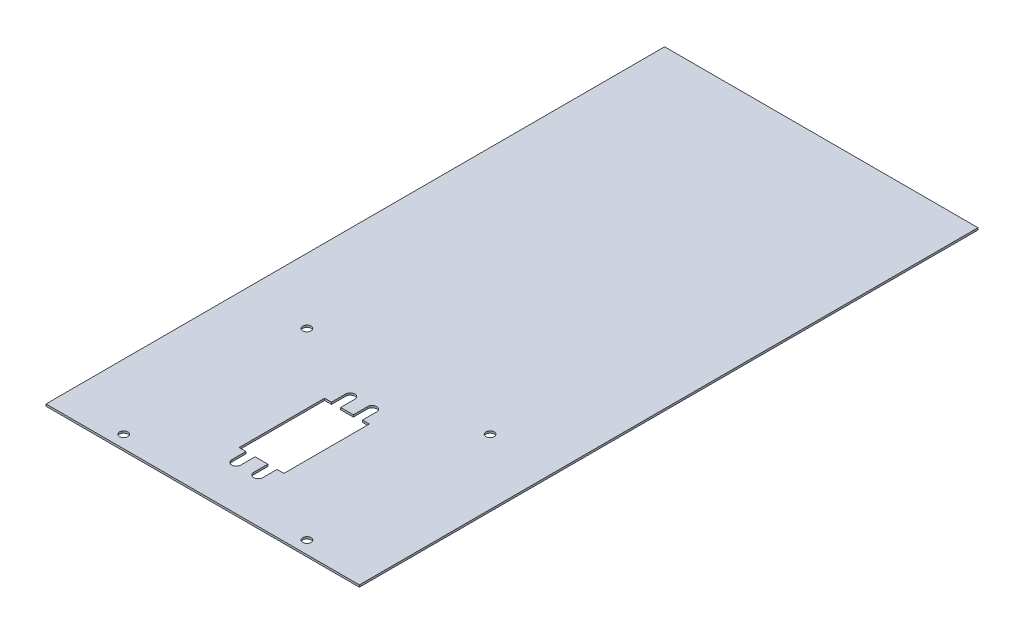
ISO-10303-21;
HEADER;
FILE_DESCRIPTION(('STEP AP214'),'2;1');
FILE_NAME('part.step','',(''),(''),'','','');
FILE_SCHEMA(('AUTOMOTIVE_DESIGN { 1 0 10303 214 1 1 1 1 }'));
ENDSEC;
DATA;
#1=APPLICATION_CONTEXT('core data for automotive mechanical design processes');
#2=APPLICATION_PROTOCOL_DEFINITION('international standard','automotive_design',2000,#1);
#3=PRODUCT_CONTEXT('',#1,'mechanical');
#4=PRODUCT('Part','Part','',(#3));
#5=PRODUCT_RELATED_PRODUCT_CATEGORY('part','',(#4));
#6=PRODUCT_DEFINITION_FORMATION('','',#4);
#7=PRODUCT_DEFINITION_CONTEXT('part definition',#1,'design');
#8=PRODUCT_DEFINITION('design','',#6,#7);
#9=PRODUCT_DEFINITION_SHAPE('','',#8);
#10=(LENGTH_UNIT() NAMED_UNIT(*) SI_UNIT(.MILLI.,.METRE.));
#11=(NAMED_UNIT(*) PLANE_ANGLE_UNIT() SI_UNIT($,.RADIAN.));
#12=(NAMED_UNIT(*) SI_UNIT($,.STERADIAN.) SOLID_ANGLE_UNIT());
#13=UNCERTAINTY_MEASURE_WITH_UNIT(LENGTH_MEASURE(1.E-05),#10,'distance_accuracy_value','');
#14=(GEOMETRIC_REPRESENTATION_CONTEXT(3) GLOBAL_UNCERTAINTY_ASSIGNED_CONTEXT((#13)) GLOBAL_UNIT_ASSIGNED_CONTEXT((#10,
#11,#12)) REPRESENTATION_CONTEXT('',''));
#15=CARTESIAN_POINT('',(0.,0.,0.));
#16=DIRECTION('',(0.,0.,1.));
#17=DIRECTION('',(1.,0.,0.));
#18=AXIS2_PLACEMENT_3D('',#15,#16,#17);
#19=CARTESIAN_POINT('',(0.,-1.,0.));
#20=DIRECTION('',(0.,1.,0.));
#21=DIRECTION('',(0.,0.,1.));
#22=AXIS2_PLACEMENT_3D('',#19,#20,#21);
#23=PLANE('',#22);
#24=CARTESIAN_POINT('',(-45.02,-0.999999999999999,263.475376963156));
#25=DIRECTION('',(0.,1.,0.));
#26=DIRECTION('',(0.,0.,1.));
#27=AXIS2_PLACEMENT_3D('',#24,#25,#26);
#28=CIRCLE('',#27,2.05000000000001);
#29=CARTESIAN_POINT('',(-45.02,-0.999999999999999,265.525376963156));
#30=VERTEX_POINT('',#29);
#31=EDGE_CURVE('E643',#30,#30,#28,.T.);
#32=ORIENTED_EDGE('',*,*,#31,.T.);
#33=EDGE_LOOP('',(#32));
#34=FACE_BOUND('',#33,.T.);
#35=CARTESIAN_POINT('',(-45.02,-0.999999999999999,173.435376963156));
#36=DIRECTION('',(0.,1.,0.));
#37=DIRECTION('',(0.,0.,1.));
#38=AXIS2_PLACEMENT_3D('',#35,#36,#37);
#39=CIRCLE('',#38,2.05);
#40=CARTESIAN_POINT('',(-45.02,-0.999999999999999,175.485376963156));
#41=VERTEX_POINT('',#40);
#42=EDGE_CURVE('E647',#41,#41,#39,.T.);
#43=ORIENTED_EDGE('',*,*,#42,.T.);
#44=EDGE_LOOP('',(#43));
#45=FACE_BOUND('',#44,.T.);
#46=CARTESIAN_POINT('',(45.02,-0.999999999999999,173.435376963156));
#47=DIRECTION('',(0.,1.,0.));
#48=DIRECTION('',(0.,0.,1.));
#49=AXIS2_PLACEMENT_3D('',#46,#47,#48);
#50=CIRCLE('',#49,2.04999999999999);
#51=CARTESIAN_POINT('',(45.02,-0.999999999999999,175.485376963156));
#52=VERTEX_POINT('',#51);
#53=EDGE_CURVE('E656',#52,#52,#50,.T.);
#54=ORIENTED_EDGE('',*,*,#53,.T.);
#55=EDGE_LOOP('',(#54));
#56=FACE_BOUND('',#55,.T.);
#57=CARTESIAN_POINT('',(45.02,-0.999999999999999,263.475376963156));
#58=DIRECTION('',(0.,1.,0.));
#59=DIRECTION('',(0.,0.,1.));
#60=AXIS2_PLACEMENT_3D('',#57,#58,#59);
#61=CIRCLE('',#60,2.05000000000001);
#62=CARTESIAN_POINT('',(45.02,-0.999999999999999,265.525376963156));
#63=VERTEX_POINT('',#62);
#64=EDGE_CURVE('E362',#63,#63,#61,.T.);
#65=ORIENTED_EDGE('',*,*,#64,.T.);
#66=EDGE_LOOP('',(#65));
#67=FACE_BOUND('',#66,.T.);
#68=DIRECTION('',(0.,0.,1.));
#69=VECTOR('',#68,1.);
#70=CARTESIAN_POINT('',(-77.,-1.,-34.3446230368444));
#71=LINE('',#70,#69);
#72=CARTESIAN_POINT('',(-77.,-1.,-34.3446230368444));
#73=VERTEX_POINT('',#72);
#74=CARTESIAN_POINT('',(-77.,-1.,269.655376963156));
#75=VERTEX_POINT('',#74);
#76=EDGE_CURVE('E494',#73,#75,#71,.T.);
#77=ORIENTED_EDGE('',*,*,#76,.F.);
#78=DIRECTION('',(-1.,0.,0.));
#79=VECTOR('',#78,1.);
#80=CARTESIAN_POINT('',(-77.,-1.,-34.3446230368444));
#81=LINE('',#80,#79);
#82=CARTESIAN_POINT('',(77.,-1.,-34.3446230368444));
#83=VERTEX_POINT('',#82);
#84=EDGE_CURVE('E504',#83,#73,#81,.T.);
#85=ORIENTED_EDGE('',*,*,#84,.F.);
#86=DIRECTION('',(0.,0.,-1.));
#87=VECTOR('',#86,1.);
#88=CARTESIAN_POINT('',(77.,-1.,-34.3446230368444));
#89=LINE('',#88,#87);
#90=CARTESIAN_POINT('',(77.,-1.,269.655376963156));
#91=VERTEX_POINT('',#90);
#92=EDGE_CURVE('E501',#91,#83,#89,.T.);
#93=ORIENTED_EDGE('',*,*,#92,.F.);
#94=DIRECTION('',(1.,0.,0.));
#95=VECTOR('',#94,1.);
#96=CARTESIAN_POINT('',(-77.,-1.,269.655376963156));
#97=LINE('',#96,#95);
#98=EDGE_CURVE('E497',#75,#91,#97,.T.);
#99=ORIENTED_EDGE('',*,*,#98,.F.);
#100=EDGE_LOOP('',(#77,#85,#93,#99));
#101=FACE_BOUND('',#100,.T.);
#102=DIRECTION('',(0.,0.,1.));
#103=VECTOR('',#102,1.);
#104=CARTESIAN_POINT('',(-3.13417677791729,-1.,0.));
#105=LINE('',#104,#103);
#106=CARTESIAN_POINT('',(-3.13417677791732,-0.999999999999999,240.755376963156));
#107=VERTEX_POINT('',#106);
#108=CARTESIAN_POINT('',(-3.13417677791732,-0.999999999999999,247.755376963156));
#109=VERTEX_POINT('',#108);
#110=EDGE_CURVE('E376',#107,#109,#105,.T.);
#111=ORIENTED_EDGE('',*,*,#110,.F.);
#112=DIRECTION('',(-1.,0.,0.));
#113=VECTOR('',#112,1.);
#114=CARTESIAN_POINT('',(0.,-1.,240.755376963156));
#115=LINE('',#114,#113);
#116=CARTESIAN_POINT('',(3.13417677791746,-1.,240.755376963156));
#117=VERTEX_POINT('',#116);
#118=EDGE_CURVE('E487',#117,#107,#115,.T.);
#119=ORIENTED_EDGE('',*,*,#118,.F.);
#120=DIRECTION('',(0.,0.,1.));
#121=VECTOR('',#120,1.);
#122=CARTESIAN_POINT('',(3.13417677791759,-1.,0.));
#123=LINE('',#122,#121);
#124=CARTESIAN_POINT('',(3.13417677791745,-0.999999999999999,247.755376963156));
#125=VERTEX_POINT('',#124);
#126=EDGE_CURVE('E205',#117,#125,#123,.T.);
#127=ORIENTED_EDGE('',*,*,#126,.T.);
#128=CARTESIAN_POINT('',(5.38417677791745,-0.999999999999999,247.755376963156));
#129=DIRECTION('',(0.,1.,0.));
#130=DIRECTION('',(0.,0.,1.));
#131=AXIS2_PLACEMENT_3D('',#128,#129,#130);
#132=CIRCLE('',#131,2.25);
#133=CARTESIAN_POINT('',(7.63417677791745,-0.999999999999999,247.755376963156));
#134=VERTEX_POINT('',#133);
#135=EDGE_CURVE('E397',#125,#134,#132,.T.);
#136=ORIENTED_EDGE('',*,*,#135,.T.);
#137=DIRECTION('',(0.,0.,1.));
#138=VECTOR('',#137,1.);
#139=CARTESIAN_POINT('',(7.63417677791759,-1.,0.));
#140=LINE('',#139,#138);
#141=CARTESIAN_POINT('',(7.63417677791746,-0.999999999999999,240.755376963156));
#142=VERTEX_POINT('',#141);
#143=EDGE_CURVE('E395',#142,#134,#140,.T.);
#144=ORIENTED_EDGE('',*,*,#143,.F.);
#145=CARTESIAN_POINT('',(11.,-0.999999999999999,240.755376963156));
#146=VERTEX_POINT('',#145);
#147=EDGE_CURVE('E483',#146,#142,#115,.T.);
#148=ORIENTED_EDGE('',*,*,#147,.F.);
#149=DIRECTION('',(0.,0.,1.));
#150=VECTOR('',#149,1.);
#151=CARTESIAN_POINT('',(11.,-1.,0.));
#152=LINE('',#151,#150);
#153=CARTESIAN_POINT('',(11.,-0.999999999999999,198.755376963156));
#154=VERTEX_POINT('',#153);
#155=EDGE_CURVE('E486',#154,#146,#152,.T.);
#156=ORIENTED_EDGE('',*,*,#155,.F.);
#157=DIRECTION('',(-1.,0.,0.));
#158=VECTOR('',#157,1.);
#159=CARTESIAN_POINT('',(0.,-1.,198.755376963156));
#160=LINE('',#159,#158);
#161=CARTESIAN_POINT('',(7.63417677791745,-1.,198.755376963156));
#162=VERTEX_POINT('',#161);
#163=EDGE_CURVE('E490',#154,#162,#160,.T.);
#164=ORIENTED_EDGE('',*,*,#163,.T.);
#165=DIRECTION('',(0.,0.,-1.));
#166=VECTOR('',#165,1.);
#167=CARTESIAN_POINT('',(7.63417677791734,-1.,0.));
#168=LINE('',#167,#166);
#169=CARTESIAN_POINT('',(7.63417677791745,-0.999999999999999,191.755376963156));
#170=VERTEX_POINT('',#169);
#171=EDGE_CURVE('E416',#162,#170,#168,.T.);
#172=ORIENTED_EDGE('',*,*,#171,.T.);
#173=CARTESIAN_POINT('',(5.38417677791745,-0.999999999999999,191.755376963156));
#174=DIRECTION('',(0.,1.,0.));
#175=DIRECTION('',(0.,0.,1.));
#176=AXIS2_PLACEMENT_3D('',#173,#174,#175);
#177=CIRCLE('',#176,2.25);
#178=CARTESIAN_POINT('',(3.13417677791745,-0.999999999999999,191.755376963156));
#179=VERTEX_POINT('',#178);
#180=EDGE_CURVE('E423',#179,#170,#177,.F.);
#181=ORIENTED_EDGE('',*,*,#180,.F.);
#182=DIRECTION('',(0.,0.,-1.));
#183=VECTOR('',#182,1.);
#184=CARTESIAN_POINT('',(3.13417677791735,-1.,0.));
#185=LINE('',#184,#183);
#186=CARTESIAN_POINT('',(3.13417677791746,-0.999999999999999,198.755376963156));
#187=VERTEX_POINT('',#186);
#188=EDGE_CURVE('E421',#187,#179,#185,.T.);
#189=ORIENTED_EDGE('',*,*,#188,.F.);
#190=CARTESIAN_POINT('',(-3.13417677791732,-0.999999999999999,198.755376963156));
#191=VERTEX_POINT('',#190);
#192=EDGE_CURVE('E489',#187,#191,#160,.T.);
#193=ORIENTED_EDGE('',*,*,#192,.T.);
#194=DIRECTION('',(0.,0.,-1.));
#195=VECTOR('',#194,1.);
#196=CARTESIAN_POINT('',(-3.13417677791735,-1.,0.));
#197=LINE('',#196,#195);
#198=CARTESIAN_POINT('',(-3.13417677791732,-1.,191.755376963156));
#199=VERTEX_POINT('',#198);
#200=EDGE_CURVE('E446',#191,#199,#197,.T.);
#201=ORIENTED_EDGE('',*,*,#200,.T.);
#202=CARTESIAN_POINT('',(-5.38417677791732,-0.999999999999999,191.755376963156));
#203=DIRECTION('',(0.,1.,0.));
#204=DIRECTION('',(0.,0.,1.));
#205=AXIS2_PLACEMENT_3D('',#202,#203,#204);
#206=CIRCLE('',#205,2.25);
#207=CARTESIAN_POINT('',(-7.63417677791732,-0.999999999999999,191.755376963156));
#208=VERTEX_POINT('',#207);
#209=EDGE_CURVE('E471',#199,#208,#206,.T.);
#210=ORIENTED_EDGE('',*,*,#209,.T.);
#211=DIRECTION('',(0.,0.,-1.));
#212=VECTOR('',#211,1.);
#213=CARTESIAN_POINT('',(-7.63417677791734,-1.,0.));
#214=LINE('',#213,#212);
#215=CARTESIAN_POINT('',(-7.63417677791732,-0.999999999999999,198.755376963156));
#216=VERTEX_POINT('',#215);
#217=EDGE_CURVE('E474',#216,#208,#214,.T.);
#218=ORIENTED_EDGE('',*,*,#217,.F.);
#219=DIRECTION('',(-1.,0.,0.));
#220=VECTOR('',#219,1.);
#221=CARTESIAN_POINT('',(0.,-1.,198.755376963156));
#222=LINE('',#221,#220);
#223=CARTESIAN_POINT('',(-11.,-0.999999999999999,198.755376963156));
#224=VERTEX_POINT('',#223);
#225=EDGE_CURVE('E476',#216,#224,#222,.T.);
#226=ORIENTED_EDGE('',*,*,#225,.T.);
#227=DIRECTION('',(0.,0.,1.));
#228=VECTOR('',#227,1.);
#229=CARTESIAN_POINT('',(-11.,-1.,0.));
#230=LINE('',#229,#228);
#231=CARTESIAN_POINT('',(-11.,-0.999999999999999,240.755376963156));
#232=VERTEX_POINT('',#231);
#233=EDGE_CURVE('E479',#224,#232,#230,.T.);
#234=ORIENTED_EDGE('',*,*,#233,.T.);
#235=CARTESIAN_POINT('',(-7.63417677791732,-1.,240.755376963156));
#236=VERTEX_POINT('',#235);
#237=EDGE_CURVE('E482',#236,#232,#115,.T.);
#238=ORIENTED_EDGE('',*,*,#237,.F.);
#239=DIRECTION('',(0.,0.,1.));
#240=VECTOR('',#239,1.);
#241=CARTESIAN_POINT('',(-7.63417677791729,-1.,0.));
#242=LINE('',#241,#240);
#243=CARTESIAN_POINT('',(-7.63417677791732,-0.999999999999999,247.755376963156));
#244=VERTEX_POINT('',#243);
#245=EDGE_CURVE('E197',#236,#244,#242,.T.);
#246=ORIENTED_EDGE('',*,*,#245,.T.);
#247=CARTESIAN_POINT('',(-5.38417677791732,-0.999999999999999,247.755376963156));
#248=DIRECTION('',(0.,1.,0.));
#249=DIRECTION('',(0.,0.,1.));
#250=AXIS2_PLACEMENT_3D('',#247,#248,#249);
#251=CIRCLE('',#250,2.25);
#252=EDGE_CURVE('E352',#109,#244,#251,.F.);
#253=ORIENTED_EDGE('',*,*,#252,.F.);
#254=EDGE_LOOP('',(#111,#119,#127,#136,#144,#148,#156,#164,#172,#181,#189,#193,#201,#210,#218,
#226,#234,#238,#246,#253));
#255=FACE_BOUND('',#254,.T.);
#256=ADVANCED_FACE('F182',(#34,#45,#56,#67,#101,#255),#23,.F.);
#257=CARTESIAN_POINT('',(0.,0.,0.));
#258=DIRECTION('',(0.,1.,0.));
#259=DIRECTION('',(0.,0.,1.));
#260=AXIS2_PLACEMENT_3D('',#257,#258,#259);
#261=PLANE('',#260);
#262=CARTESIAN_POINT('',(-45.02,0.,263.475376963156));
#263=DIRECTION('',(0.,1.,0.));
#264=DIRECTION('',(0.,0.,1.));
#265=AXIS2_PLACEMENT_3D('',#262,#263,#264);
#266=CIRCLE('',#265,2.05000000000001);
#267=CARTESIAN_POINT('',(-45.02,0.,265.525376963156));
#268=VERTEX_POINT('',#267);
#269=EDGE_CURVE('E641',#268,#268,#266,.T.);
#270=ORIENTED_EDGE('',*,*,#269,.F.);
#271=EDGE_LOOP('',(#270));
#272=FACE_BOUND('',#271,.T.);
#273=CARTESIAN_POINT('',(-45.02,0.,173.435376963156));
#274=DIRECTION('',(0.,1.,0.));
#275=DIRECTION('',(0.,0.,1.));
#276=AXIS2_PLACEMENT_3D('',#273,#274,#275);
#277=CIRCLE('',#276,2.05);
#278=CARTESIAN_POINT('',(-45.02,0.,175.485376963156));
#279=VERTEX_POINT('',#278);
#280=EDGE_CURVE('E644',#279,#279,#277,.T.);
#281=ORIENTED_EDGE('',*,*,#280,.F.);
#282=EDGE_LOOP('',(#281));
#283=FACE_BOUND('',#282,.T.);
#284=CARTESIAN_POINT('',(45.02,0.,173.435376963156));
#285=DIRECTION('',(0.,1.,0.));
#286=DIRECTION('',(0.,0.,1.));
#287=AXIS2_PLACEMENT_3D('',#284,#285,#286);
#288=CIRCLE('',#287,2.04999999999999);
#289=CARTESIAN_POINT('',(45.02,0.,175.485376963156));
#290=VERTEX_POINT('',#289);
#291=EDGE_CURVE('E653',#290,#290,#288,.T.);
#292=ORIENTED_EDGE('',*,*,#291,.F.);
#293=EDGE_LOOP('',(#292));
#294=FACE_BOUND('',#293,.T.);
#295=CARTESIAN_POINT('',(45.02,0.,263.475376963156));
#296=DIRECTION('',(0.,1.,0.));
#297=DIRECTION('',(0.,0.,1.));
#298=AXIS2_PLACEMENT_3D('',#295,#296,#297);
#299=CIRCLE('',#298,2.05000000000001);
#300=CARTESIAN_POINT('',(45.02,0.,265.525376963156));
#301=VERTEX_POINT('',#300);
#302=EDGE_CURVE('E659',#301,#301,#299,.T.);
#303=ORIENTED_EDGE('',*,*,#302,.F.);
#304=EDGE_LOOP('',(#303));
#305=FACE_BOUND('',#304,.T.);
#306=DIRECTION('',(0.,0.,1.));
#307=VECTOR('',#306,1.);
#308=CARTESIAN_POINT('',(-77.,0.,-34.3446230368444));
#309=LINE('',#308,#307);
#310=CARTESIAN_POINT('',(-77.,0.,-34.3446230368444));
#311=VERTEX_POINT('',#310);
#312=CARTESIAN_POINT('',(-77.,0.,269.655376963156));
#313=VERTEX_POINT('',#312);
#314=EDGE_CURVE('E493',#311,#313,#309,.T.);
#315=ORIENTED_EDGE('',*,*,#314,.T.);
#316=DIRECTION('',(1.,0.,0.));
#317=VECTOR('',#316,1.);
#318=CARTESIAN_POINT('',(-77.,0.,269.655376963156));
#319=LINE('',#318,#317);
#320=CARTESIAN_POINT('',(77.,0.,269.655376963156));
#321=VERTEX_POINT('',#320);
#322=EDGE_CURVE('E510',#313,#321,#319,.T.);
#323=ORIENTED_EDGE('',*,*,#322,.T.);
#324=DIRECTION('',(0.,0.,-1.));
#325=VECTOR('',#324,1.);
#326=CARTESIAN_POINT('',(77.,0.,-34.3446230368444));
#327=LINE('',#326,#325);
#328=CARTESIAN_POINT('',(77.,0.,-34.3446230368444));
#329=VERTEX_POINT('',#328);
#330=EDGE_CURVE('E513',#321,#329,#327,.T.);
#331=ORIENTED_EDGE('',*,*,#330,.T.);
#332=DIRECTION('',(-1.,0.,0.));
#333=VECTOR('',#332,1.);
#334=CARTESIAN_POINT('',(-77.,0.,-34.3446230368444));
#335=LINE('',#334,#333);
#336=EDGE_CURVE('E498',#329,#311,#335,.T.);
#337=ORIENTED_EDGE('',*,*,#336,.T.);
#338=EDGE_LOOP('',(#315,#323,#331,#337));
#339=FACE_BOUND('',#338,.T.);
#340=DIRECTION('',(-1.,0.,0.));
#341=VECTOR('',#340,1.);
#342=CARTESIAN_POINT('',(0.,0.,240.755376963156));
#343=LINE('',#342,#341);
#344=CARTESIAN_POINT('',(3.13417677791746,0.,240.755376963156));
#345=VERTEX_POINT('',#344);
#346=CARTESIAN_POINT('',(-3.13417677791732,0.,240.755376963156));
#347=VERTEX_POINT('',#346);
#348=EDGE_CURVE('E440',#345,#347,#343,.T.);
#349=ORIENTED_EDGE('',*,*,#348,.T.);
#350=DIRECTION('',(0.,0.,1.));
#351=VECTOR('',#350,1.);
#352=CARTESIAN_POINT('',(-3.13417677791732,0.,233.755376963156));
#353=LINE('',#352,#351);
#354=CARTESIAN_POINT('',(-3.13417677791732,0.,247.755376963156));
#355=VERTEX_POINT('',#354);
#356=EDGE_CURVE('E354',#347,#355,#353,.T.);
#357=ORIENTED_EDGE('',*,*,#356,.T.);
#358=CARTESIAN_POINT('',(-5.38417677791732,0.,247.755376963156));
#359=DIRECTION('',(0.,-1.,0.));
#360=DIRECTION('',(0.,0.,-1.));
#361=AXIS2_PLACEMENT_3D('',#358,#359,#360);
#362=CIRCLE('',#361,2.25);
#363=CARTESIAN_POINT('',(-7.63417677791732,0.,247.755376963156));
#364=VERTEX_POINT('',#363);
#365=EDGE_CURVE('E349',#355,#364,#362,.T.);
#366=ORIENTED_EDGE('',*,*,#365,.T.);
#367=DIRECTION('',(0.,0.,1.));
#368=VECTOR('',#367,1.);
#369=CARTESIAN_POINT('',(-7.63417677791732,0.,233.755376963156));
#370=LINE('',#369,#368);
#371=CARTESIAN_POINT('',(-7.63417677791732,0.,240.755376963156));
#372=VERTEX_POINT('',#371);
#373=EDGE_CURVE('E357',#372,#364,#370,.T.);
#374=ORIENTED_EDGE('',*,*,#373,.F.);
#375=CARTESIAN_POINT('',(-11.,0.,240.755376963156));
#376=VERTEX_POINT('',#375);
#377=EDGE_CURVE('E435',#372,#376,#343,.T.);
#378=ORIENTED_EDGE('',*,*,#377,.T.);
#379=DIRECTION('',(0.,0.,1.));
#380=VECTOR('',#379,1.);
#381=CARTESIAN_POINT('',(-11.,0.,0.));
#382=LINE('',#381,#380);
#383=CARTESIAN_POINT('',(-11.,0.,198.755376963156));
#384=VERTEX_POINT('',#383);
#385=EDGE_CURVE('E429',#384,#376,#382,.T.);
#386=ORIENTED_EDGE('',*,*,#385,.F.);
#387=DIRECTION('',(-1.,0.,0.));
#388=VECTOR('',#387,1.);
#389=CARTESIAN_POINT('',(0.,0.,198.755376963156));
#390=LINE('',#389,#388);
#391=CARTESIAN_POINT('',(-7.63417677791732,0.,198.755376963156));
#392=VERTEX_POINT('',#391);
#393=EDGE_CURVE('E426',#392,#384,#390,.T.);
#394=ORIENTED_EDGE('',*,*,#393,.F.);
#395=DIRECTION('',(0.,0.,-1.));
#396=VECTOR('',#395,1.);
#397=CARTESIAN_POINT('',(-7.63417677791732,0.,205.755376963156));
#398=LINE('',#397,#396);
#399=CARTESIAN_POINT('',(-7.63417677791732,0.,191.755376963156));
#400=VERTEX_POINT('',#399);
#401=EDGE_CURVE('E463',#392,#400,#398,.T.);
#402=ORIENTED_EDGE('',*,*,#401,.T.);
#403=CARTESIAN_POINT('',(-5.38417677791732,0.,191.755376963156));
#404=DIRECTION('',(0.,1.,0.));
#405=DIRECTION('',(0.,0.,1.));
#406=AXIS2_PLACEMENT_3D('',#403,#404,#405);
#407=CIRCLE('',#406,2.25);
#408=CARTESIAN_POINT('',(-3.13417677791732,0.,191.755376963156));
#409=VERTEX_POINT('',#408);
#410=EDGE_CURVE('E460',#409,#400,#407,.T.);
#411=ORIENTED_EDGE('',*,*,#410,.F.);
#412=DIRECTION('',(0.,0.,-1.));
#413=VECTOR('',#412,1.);
#414=CARTESIAN_POINT('',(-3.13417677791732,0.,205.755376963156));
#415=LINE('',#414,#413);
#416=CARTESIAN_POINT('',(-3.13417677791732,0.,198.755376963156));
#417=VERTEX_POINT('',#416);
#418=EDGE_CURVE('E425',#417,#409,#415,.T.);
#419=ORIENTED_EDGE('',*,*,#418,.F.);
#420=CARTESIAN_POINT('',(3.13417677791746,0.,198.755376963156));
#421=VERTEX_POINT('',#420);
#422=EDGE_CURVE('E431',#421,#417,#390,.T.);
#423=ORIENTED_EDGE('',*,*,#422,.F.);
#424=DIRECTION('',(0.,0.,-1.));
#425=VECTOR('',#424,1.);
#426=CARTESIAN_POINT('',(3.13417677791746,0.,205.755376963156));
#427=LINE('',#426,#425);
#428=CARTESIAN_POINT('',(3.13417677791745,0.,191.755376963156));
#429=VERTEX_POINT('',#428);
#430=EDGE_CURVE('E406',#421,#429,#427,.T.);
#431=ORIENTED_EDGE('',*,*,#430,.T.);
#432=CARTESIAN_POINT('',(5.38417677791745,0.,191.755376963156));
#433=DIRECTION('',(0.,-1.,0.));
#434=DIRECTION('',(0.,0.,1.));
#435=AXIS2_PLACEMENT_3D('',#432,#433,#434);
#436=CIRCLE('',#435,2.25);
#437=CARTESIAN_POINT('',(7.63417677791745,0.,191.755376963156));
#438=VERTEX_POINT('',#437);
#439=EDGE_CURVE('E403',#429,#438,#436,.T.);
#440=ORIENTED_EDGE('',*,*,#439,.T.);
#441=DIRECTION('',(0.,0.,-1.));
#442=VECTOR('',#441,1.);
#443=CARTESIAN_POINT('',(7.63417677791746,0.,205.755376963156));
#444=LINE('',#443,#442);
#445=CARTESIAN_POINT('',(7.63417677791745,0.,198.755376963156));
#446=VERTEX_POINT('',#445);
#447=EDGE_CURVE('E400',#446,#438,#444,.T.);
#448=ORIENTED_EDGE('',*,*,#447,.F.);
#449=CARTESIAN_POINT('',(11.,0.,198.755376963156));
#450=VERTEX_POINT('',#449);
#451=EDGE_CURVE('E432',#450,#446,#390,.T.);
#452=ORIENTED_EDGE('',*,*,#451,.F.);
#453=DIRECTION('',(0.,0.,1.));
#454=VECTOR('',#453,1.);
#455=CARTESIAN_POINT('',(11.,0.,0.));
#456=LINE('',#455,#454);
#457=CARTESIAN_POINT('',(11.,0.,240.755376963156));
#458=VERTEX_POINT('',#457);
#459=EDGE_CURVE('E439',#450,#458,#456,.T.);
#460=ORIENTED_EDGE('',*,*,#459,.T.);
#461=CARTESIAN_POINT('',(7.63417677791746,0.,240.755376963156));
#462=VERTEX_POINT('',#461);
#463=EDGE_CURVE('E436',#458,#462,#343,.T.);
#464=ORIENTED_EDGE('',*,*,#463,.T.);
#465=DIRECTION('',(0.,0.,1.));
#466=VECTOR('',#465,1.);
#467=CARTESIAN_POINT('',(7.63417677791746,0.,233.755376963156));
#468=LINE('',#467,#466);
#469=CARTESIAN_POINT('',(7.63417677791745,0.,247.755376963156));
#470=VERTEX_POINT('',#469);
#471=EDGE_CURVE('E385',#462,#470,#468,.T.);
#472=ORIENTED_EDGE('',*,*,#471,.T.);
#473=CARTESIAN_POINT('',(5.38417677791745,0.,247.755376963156));
#474=DIRECTION('',(0.,1.,0.));
#475=DIRECTION('',(0.,0.,-1.));
#476=AXIS2_PLACEMENT_3D('',#473,#474,#475);
#477=CIRCLE('',#476,2.25);
#478=CARTESIAN_POINT('',(3.13417677791745,0.,247.755376963156));
#479=VERTEX_POINT('',#478);
#480=EDGE_CURVE('E382',#479,#470,#477,.T.);
#481=ORIENTED_EDGE('',*,*,#480,.F.);
#482=DIRECTION('',(0.,0.,1.));
#483=VECTOR('',#482,1.);
#484=CARTESIAN_POINT('',(3.13417677791746,0.,233.755376963156));
#485=LINE('',#484,#483);
#486=EDGE_CURVE('E379',#345,#479,#485,.T.);
#487=ORIENTED_EDGE('',*,*,#486,.F.);
#488=EDGE_LOOP('',(#349,#357,#366,#374,#378,#386,#394,#402,#411,#419,#423,#431,#440,#448,#452,
#460,#464,#472,#481,#487));
#489=FACE_BOUND('',#488,.T.);
#490=ADVANCED_FACE('F365',(#272,#283,#294,#305,#339,#489),#261,.T.);
#491=CARTESIAN_POINT('',(0.,-10.,240.755376963156));
#492=DIRECTION('',(0.,0.,-1.));
#493=DIRECTION('',(-1.,0.,0.));
#494=AXIS2_PLACEMENT_3D('',#491,#492,#493);
#495=PLANE('',#494);
#496=ORIENTED_EDGE('',*,*,#118,.T.);
#497=DIRECTION('',(0.,1.,0.));
#498=VECTOR('',#497,1.);
#499=CARTESIAN_POINT('',(-3.13417677791732,-10.,240.755376963156));
#500=LINE('',#499,#498);
#501=EDGE_CURVE('E370',#107,#347,#500,.T.);
#502=ORIENTED_EDGE('',*,*,#501,.T.);
#503=ORIENTED_EDGE('',*,*,#348,.F.);
#504=DIRECTION('',(0.,1.,0.));
#505=VECTOR('',#504,1.);
#506=CARTESIAN_POINT('',(3.13417677791746,-10.,240.755376963156));
#507=LINE('',#506,#505);
#508=EDGE_CURVE('E391',#117,#345,#507,.T.);
#509=ORIENTED_EDGE('',*,*,#508,.F.);
#510=EDGE_LOOP('',(#496,#502,#503,#509));
#511=FACE_BOUND('',#510,.T.);
#512=ADVANCED_FACE('F554',(#511),#495,.T.);
#513=ORIENTED_EDGE('',*,*,#147,.T.);
#514=DIRECTION('',(0.,1.,0.));
#515=VECTOR('',#514,1.);
#516=CARTESIAN_POINT('',(7.63417677791745,-10.,240.755376963156));
#517=LINE('',#516,#515);
#518=EDGE_CURVE('E12',#142,#462,#517,.T.);
#519=ORIENTED_EDGE('',*,*,#518,.T.);
#520=ORIENTED_EDGE('',*,*,#463,.F.);
#521=DIRECTION('',(0.,1.,0.));
#522=VECTOR('',#521,1.);
#523=CARTESIAN_POINT('',(11.,-10.,240.755376963156));
#524=LINE('',#523,#522);
#525=EDGE_CURVE('E449',#146,#458,#524,.T.);
#526=ORIENTED_EDGE('',*,*,#525,.F.);
#527=EDGE_LOOP('',(#513,#519,#520,#526));
#528=FACE_BOUND('',#527,.T.);
#529=ADVANCED_FACE('F583',(#528),#495,.T.);
#530=CARTESIAN_POINT('',(0.,-10.,198.755376963156));
#531=DIRECTION('',(0.,0.,-1.));
#532=DIRECTION('',(-1.,0.,0.));
#533=AXIS2_PLACEMENT_3D('',#530,#531,#532);
#534=PLANE('',#533);
#535=DIRECTION('',(0.,1.,0.));
#536=VECTOR('',#535,1.);
#537=CARTESIAN_POINT('',(3.13417677791746,-10.,198.755376963156));
#538=LINE('',#537,#536);
#539=EDGE_CURVE('E412',#187,#421,#538,.T.);
#540=ORIENTED_EDGE('',*,*,#539,.T.);
#541=ORIENTED_EDGE('',*,*,#422,.T.);
#542=DIRECTION('',(0.,1.,0.));
#543=VECTOR('',#542,1.);
#544=CARTESIAN_POINT('',(-3.13417677791732,-10.,198.755376963156));
#545=LINE('',#544,#543);
#546=EDGE_CURVE('E443',#191,#417,#545,.T.);
#547=ORIENTED_EDGE('',*,*,#546,.F.);
#548=ORIENTED_EDGE('',*,*,#192,.F.);
#549=EDGE_LOOP('',(#540,#541,#547,#548));
#550=FACE_BOUND('',#549,.T.);
#551=ADVANCED_FACE('F590',(#550),#534,.F.);
#552=CARTESIAN_POINT('',(-77.,-1.,-34.3446230368444));
#553=DIRECTION('',(-1.,0.,0.));
#554=DIRECTION('',(0.,0.,1.));
#555=AXIS2_PLACEMENT_3D('',#552,#553,#554);
#556=PLANE('',#555);
#557=ORIENTED_EDGE('',*,*,#314,.F.);
#558=DIRECTION('',(0.,1.,0.));
#559=VECTOR('',#558,1.);
#560=CARTESIAN_POINT('',(-77.,-1.,-34.3446230368444));
#561=LINE('',#560,#559);
#562=EDGE_CURVE('E190',#73,#311,#561,.T.);
#563=ORIENTED_EDGE('',*,*,#562,.F.);
#564=ORIENTED_EDGE('',*,*,#76,.T.);
#565=DIRECTION('',(0.,1.,0.));
#566=VECTOR('',#565,1.);
#567=CARTESIAN_POINT('',(-77.,-1.,269.655376963156));
#568=LINE('',#567,#566);
#569=EDGE_CURVE('E507',#75,#313,#568,.T.);
#570=ORIENTED_EDGE('',*,*,#569,.T.);
#571=EDGE_LOOP('',(#557,#563,#564,#570));
#572=FACE_BOUND('',#571,.T.);
#573=ADVANCED_FACE('F184',(#572),#556,.T.);
#574=CARTESIAN_POINT('',(-77.,-1.,-34.3446230368444));
#575=DIRECTION('',(0.,0.,-1.));
#576=DIRECTION('',(-1.,0.,0.));
#577=AXIS2_PLACEMENT_3D('',#574,#575,#576);
#578=PLANE('',#577);
#579=ORIENTED_EDGE('',*,*,#336,.F.);
#580=DIRECTION('',(0.,1.,0.));
#581=VECTOR('',#580,1.);
#582=CARTESIAN_POINT('',(77.,-1.,-34.3446230368444));
#583=LINE('',#582,#581);
#584=EDGE_CURVE('E519',#83,#329,#583,.T.);
#585=ORIENTED_EDGE('',*,*,#584,.F.);
#586=ORIENTED_EDGE('',*,*,#84,.T.);
#587=ORIENTED_EDGE('',*,*,#562,.T.);
#588=EDGE_LOOP('',(#579,#585,#586,#587));
#589=FACE_BOUND('',#588,.T.);
#590=ADVANCED_FACE('F533',(#589),#578,.T.);
#591=CARTESIAN_POINT('',(77.,-1.,-34.3446230368444));
#592=DIRECTION('',(1.,0.,0.));
#593=DIRECTION('',(0.,0.,-1.));
#594=AXIS2_PLACEMENT_3D('',#591,#592,#593);
#595=PLANE('',#594);
#596=ORIENTED_EDGE('',*,*,#330,.F.);
#597=DIRECTION('',(0.,1.,0.));
#598=VECTOR('',#597,1.);
#599=CARTESIAN_POINT('',(77.,-1.,269.655376963156));
#600=LINE('',#599,#598);
#601=EDGE_CURVE('E521',#91,#321,#600,.T.);
#602=ORIENTED_EDGE('',*,*,#601,.F.);
#603=ORIENTED_EDGE('',*,*,#92,.T.);
#604=ORIENTED_EDGE('',*,*,#584,.T.);
#605=EDGE_LOOP('',(#596,#602,#603,#604));
#606=FACE_BOUND('',#605,.T.);
#607=ADVANCED_FACE('F539',(#606),#595,.T.);
#608=CARTESIAN_POINT('',(-77.,-1.,269.655376963156));
#609=DIRECTION('',(0.,0.,1.));
#610=DIRECTION('',(1.,0.,0.));
#611=AXIS2_PLACEMENT_3D('',#608,#609,#610);
#612=PLANE('',#611);
#613=ORIENTED_EDGE('',*,*,#322,.F.);
#614=ORIENTED_EDGE('',*,*,#569,.F.);
#615=ORIENTED_EDGE('',*,*,#98,.T.);
#616=ORIENTED_EDGE('',*,*,#601,.T.);
#617=EDGE_LOOP('',(#613,#614,#615,#616));
#618=FACE_BOUND('',#617,.T.);
#619=ADVANCED_FACE('F528',(#618),#612,.T.);
#620=ORIENTED_EDGE('',*,*,#451,.T.);
#621=DIRECTION('',(0.,1.,0.));
#622=VECTOR('',#621,1.);
#623=CARTESIAN_POINT('',(7.63417677791746,-10.,198.755376963156));
#624=LINE('',#623,#622);
#625=EDGE_CURVE('E414',#162,#446,#624,.T.);
#626=ORIENTED_EDGE('',*,*,#625,.F.);
#627=ORIENTED_EDGE('',*,*,#163,.F.);
#628=DIRECTION('',(0.,1.,0.));
#629=VECTOR('',#628,1.);
#630=CARTESIAN_POINT('',(11.,-10.,198.755376963156));
#631=LINE('',#630,#629);
#632=EDGE_CURVE('E447',#154,#450,#631,.T.);
#633=ORIENTED_EDGE('',*,*,#632,.T.);
#634=EDGE_LOOP('',(#620,#626,#627,#633));
#635=FACE_BOUND('',#634,.T.);
#636=ADVANCED_FACE('F546',(#635),#534,.F.);
#637=CARTESIAN_POINT('',(11.,-10.,0.));
#638=DIRECTION('',(-1.,0.,0.));
#639=DIRECTION('',(0.,0.,1.));
#640=AXIS2_PLACEMENT_3D('',#637,#638,#639);
#641=PLANE('',#640);
#642=ORIENTED_EDGE('',*,*,#155,.T.);
#643=ORIENTED_EDGE('',*,*,#525,.T.);
#644=ORIENTED_EDGE('',*,*,#459,.F.);
#645=ORIENTED_EDGE('',*,*,#632,.F.);
#646=EDGE_LOOP('',(#642,#643,#644,#645));
#647=FACE_BOUND('',#646,.T.);
#648=ADVANCED_FACE('F581',(#647),#641,.T.);
#649=DIRECTION('',(0.,1.,0.));
#650=VECTOR('',#649,1.);
#651=CARTESIAN_POINT('',(-7.63417677791732,-10.,240.755376963156));
#652=LINE('',#651,#650);
#653=EDGE_CURVE('E359',#236,#372,#652,.T.);
#654=ORIENTED_EDGE('',*,*,#653,.F.);
#655=ORIENTED_EDGE('',*,*,#237,.T.);
#656=DIRECTION('',(0.,1.,0.));
#657=VECTOR('',#656,1.);
#658=CARTESIAN_POINT('',(-11.,-10.,240.755376963156));
#659=LINE('',#658,#657);
#660=EDGE_CURVE('E451',#232,#376,#659,.T.);
#661=ORIENTED_EDGE('',*,*,#660,.T.);
#662=ORIENTED_EDGE('',*,*,#377,.F.);
#663=EDGE_LOOP('',(#654,#655,#661,#662));
#664=FACE_BOUND('',#663,.T.);
#665=ADVANCED_FACE('F577',(#664),#495,.T.);
#666=CARTESIAN_POINT('',(-11.,-10.,0.));
#667=DIRECTION('',(-1.,0.,0.));
#668=DIRECTION('',(0.,0.,1.));
#669=AXIS2_PLACEMENT_3D('',#666,#667,#668);
#670=PLANE('',#669);
#671=DIRECTION('',(0.,1.,0.));
#672=VECTOR('',#671,1.);
#673=CARTESIAN_POINT('',(-11.,-10.,198.755376963156));
#674=LINE('',#673,#672);
#675=EDGE_CURVE('E454',#224,#384,#674,.T.);
#676=ORIENTED_EDGE('',*,*,#675,.T.);
#677=ORIENTED_EDGE('',*,*,#385,.T.);
#678=ORIENTED_EDGE('',*,*,#660,.F.);
#679=ORIENTED_EDGE('',*,*,#233,.F.);
#680=EDGE_LOOP('',(#676,#677,#678,#679));
#681=FACE_BOUND('',#680,.T.);
#682=ADVANCED_FACE('F574',(#681),#670,.F.);
#683=DIRECTION('',(0.,1.,0.));
#684=VECTOR('',#683,1.);
#685=CARTESIAN_POINT('',(-7.63417677791732,-10.,198.755376963156));
#686=LINE('',#685,#684);
#687=EDGE_CURVE('E456',#216,#392,#686,.T.);
#688=ORIENTED_EDGE('',*,*,#687,.T.);
#689=ORIENTED_EDGE('',*,*,#393,.T.);
#690=ORIENTED_EDGE('',*,*,#675,.F.);
#691=ORIENTED_EDGE('',*,*,#225,.F.);
#692=EDGE_LOOP('',(#688,#689,#690,#691));
#693=FACE_BOUND('',#692,.T.);
#694=ADVANCED_FACE('F572',(#693),#534,.F.);
#695=CARTESIAN_POINT('',(-7.63417677791732,-10.,205.755376963156));
#696=DIRECTION('',(1.,0.,0.));
#697=DIRECTION('',(0.,0.,-1.));
#698=AXIS2_PLACEMENT_3D('',#695,#696,#697);
#699=PLANE('',#698);
#700=ORIENTED_EDGE('',*,*,#217,.T.);
#701=DIRECTION('',(0.,1.,0.));
#702=VECTOR('',#701,1.);
#703=CARTESIAN_POINT('',(-7.63417677791732,-10.,191.755376963156));
#704=LINE('',#703,#702);
#705=EDGE_CURVE('E430',#208,#400,#704,.T.);
#706=ORIENTED_EDGE('',*,*,#705,.T.);
#707=ORIENTED_EDGE('',*,*,#401,.F.);
#708=ORIENTED_EDGE('',*,*,#687,.F.);
#709=EDGE_LOOP('',(#700,#706,#707,#708));
#710=FACE_BOUND('',#709,.T.);
#711=ADVANCED_FACE('F568',(#710),#699,.T.);
#712=CARTESIAN_POINT('',(-5.38417677791732,-10.,191.755376963156));
#713=DIRECTION('',(0.,1.,0.));
#714=DIRECTION('',(0.,0.,1.));
#715=AXIS2_PLACEMENT_3D('',#712,#713,#714);
#716=CYLINDRICAL_SURFACE('',#715,2.25);
#717=DIRECTION('',(0.,1.,0.));
#718=VECTOR('',#717,1.);
#719=CARTESIAN_POINT('',(-3.13417677791732,-10.,191.755376963156));
#720=LINE('',#719,#718);
#721=EDGE_CURVE('E466',#199,#409,#720,.T.);
#722=ORIENTED_EDGE('',*,*,#721,.T.);
#723=ORIENTED_EDGE('',*,*,#410,.T.);
#724=ORIENTED_EDGE('',*,*,#705,.F.);
#725=ORIENTED_EDGE('',*,*,#209,.F.);
#726=EDGE_LOOP('',(#722,#723,#724,#725));
#727=FACE_BOUND('',#726,.T.);
#728=ADVANCED_FACE('F564',(#727),#716,.F.);
#729=CARTESIAN_POINT('',(-3.13417677791732,-10.,205.755376963156));
#730=DIRECTION('',(1.,0.,0.));
#731=DIRECTION('',(0.,0.,-1.));
#732=AXIS2_PLACEMENT_3D('',#729,#730,#731);
#733=PLANE('',#732);
#734=ORIENTED_EDGE('',*,*,#546,.T.);
#735=ORIENTED_EDGE('',*,*,#418,.T.);
#736=ORIENTED_EDGE('',*,*,#721,.F.);
#737=ORIENTED_EDGE('',*,*,#200,.F.);
#738=EDGE_LOOP('',(#734,#735,#736,#737));
#739=FACE_BOUND('',#738,.T.);
#740=ADVANCED_FACE('F560',(#739),#733,.F.);
#741=CARTESIAN_POINT('',(5.38417677791745,-10.,191.755376963156));
#742=DIRECTION('',(0.,1.,0.));
#743=DIRECTION('',(0.,0.,1.));
#744=AXIS2_PLACEMENT_3D('',#741,#742,#743);
#745=CYLINDRICAL_SURFACE('',#744,2.25);
#746=ORIENTED_EDGE('',*,*,#180,.T.);
#747=DIRECTION('',(0.,1.,0.));
#748=VECTOR('',#747,1.);
#749=CARTESIAN_POINT('',(7.63417677791745,-10.,191.755376963156));
#750=LINE('',#749,#748);
#751=EDGE_CURVE('E409',#170,#438,#750,.T.);
#752=ORIENTED_EDGE('',*,*,#751,.T.);
#753=ORIENTED_EDGE('',*,*,#439,.F.);
#754=DIRECTION('',(0.,1.,0.));
#755=VECTOR('',#754,1.);
#756=CARTESIAN_POINT('',(3.13417677791745,-10.,191.755376963156));
#757=LINE('',#756,#755);
#758=EDGE_CURVE('E410',#179,#429,#757,.T.);
#759=ORIENTED_EDGE('',*,*,#758,.F.);
#760=EDGE_LOOP('',(#746,#752,#753,#759));
#761=FACE_BOUND('',#760,.T.);
#762=ADVANCED_FACE('F563',(#761),#745,.F.);
#763=CARTESIAN_POINT('',(3.13417677791746,-10.,205.755376963156));
#764=DIRECTION('',(1.,0.,0.));
#765=DIRECTION('',(0.,0.,-1.));
#766=AXIS2_PLACEMENT_3D('',#763,#764,#765);
#767=PLANE('',#766);
#768=ORIENTED_EDGE('',*,*,#188,.T.);
#769=ORIENTED_EDGE('',*,*,#758,.T.);
#770=ORIENTED_EDGE('',*,*,#430,.F.);
#771=ORIENTED_EDGE('',*,*,#539,.F.);
#772=EDGE_LOOP('',(#768,#769,#770,#771));
#773=FACE_BOUND('',#772,.T.);
#774=ADVANCED_FACE('F595',(#773),#767,.T.);
#775=CARTESIAN_POINT('',(7.63417677791746,-10.,205.755376963156));
#776=DIRECTION('',(1.,0.,0.));
#777=DIRECTION('',(0.,0.,-1.));
#778=AXIS2_PLACEMENT_3D('',#775,#776,#777);
#779=PLANE('',#778);
#780=ORIENTED_EDGE('',*,*,#625,.T.);
#781=ORIENTED_EDGE('',*,*,#447,.T.);
#782=ORIENTED_EDGE('',*,*,#751,.F.);
#783=ORIENTED_EDGE('',*,*,#171,.F.);
#784=EDGE_LOOP('',(#780,#781,#782,#783));
#785=FACE_BOUND('',#784,.T.);
#786=ADVANCED_FACE('F591',(#785),#779,.F.);
#787=CARTESIAN_POINT('',(5.38417677791745,-10.,247.755376963156));
#788=DIRECTION('',(0.,1.,0.));
#789=DIRECTION('',(0.,0.,1.));
#790=AXIS2_PLACEMENT_3D('',#787,#788,#789);
#791=CYLINDRICAL_SURFACE('',#790,2.25);
#792=DIRECTION('',(0.,1.,0.));
#793=VECTOR('',#792,1.);
#794=CARTESIAN_POINT('',(3.13417677791745,-10.,247.755376963156));
#795=LINE('',#794,#793);
#796=EDGE_CURVE('E388',#125,#479,#795,.T.);
#797=ORIENTED_EDGE('',*,*,#796,.T.);
#798=ORIENTED_EDGE('',*,*,#480,.T.);
#799=DIRECTION('',(0.,1.,0.));
#800=VECTOR('',#799,1.);
#801=CARTESIAN_POINT('',(7.63417677791745,-10.,247.755376963156));
#802=LINE('',#801,#800);
#803=EDGE_CURVE('E389',#134,#470,#802,.T.);
#804=ORIENTED_EDGE('',*,*,#803,.F.);
#805=ORIENTED_EDGE('',*,*,#135,.F.);
#806=EDGE_LOOP('',(#797,#798,#804,#805));
#807=FACE_BOUND('',#806,.T.);
#808=ADVANCED_FACE('F594',(#807),#791,.F.);
#809=CARTESIAN_POINT('',(7.63417677791746,-10.,233.755376963156));
#810=DIRECTION('',(-1.,0.,0.));
#811=DIRECTION('',(0.,0.,1.));
#812=AXIS2_PLACEMENT_3D('',#809,#810,#811);
#813=PLANE('',#812);
#814=ORIENTED_EDGE('',*,*,#143,.T.);
#815=ORIENTED_EDGE('',*,*,#803,.T.);
#816=ORIENTED_EDGE('',*,*,#471,.F.);
#817=ORIENTED_EDGE('',*,*,#518,.F.);
#818=EDGE_LOOP('',(#814,#815,#816,#817));
#819=FACE_BOUND('',#818,.T.);
#820=ADVANCED_FACE('F606',(#819),#813,.T.);
#821=CARTESIAN_POINT('',(3.13417677791746,-10.,233.755376963156));
#822=DIRECTION('',(-1.,0.,0.));
#823=DIRECTION('',(0.,0.,1.));
#824=AXIS2_PLACEMENT_3D('',#821,#822,#823);
#825=PLANE('',#824);
#826=ORIENTED_EDGE('',*,*,#508,.T.);
#827=ORIENTED_EDGE('',*,*,#486,.T.);
#828=ORIENTED_EDGE('',*,*,#796,.F.);
#829=ORIENTED_EDGE('',*,*,#126,.F.);
#830=EDGE_LOOP('',(#826,#827,#828,#829));
#831=FACE_BOUND('',#830,.T.);
#832=ADVANCED_FACE('F603',(#831),#825,.F.);
#833=CARTESIAN_POINT('',(-5.38417677791732,-10.,247.755376963156));
#834=DIRECTION('',(0.,1.,0.));
#835=DIRECTION('',(0.,0.,1.));
#836=AXIS2_PLACEMENT_3D('',#833,#834,#835);
#837=CYLINDRICAL_SURFACE('',#836,2.25);
#838=ORIENTED_EDGE('',*,*,#252,.T.);
#839=DIRECTION('',(0.,1.,0.));
#840=VECTOR('',#839,1.);
#841=CARTESIAN_POINT('',(-7.63417677791732,-10.,247.755376963156));
#842=LINE('',#841,#840);
#843=EDGE_CURVE('E344',#244,#364,#842,.T.);
#844=ORIENTED_EDGE('',*,*,#843,.T.);
#845=ORIENTED_EDGE('',*,*,#365,.F.);
#846=DIRECTION('',(0.,1.,0.));
#847=VECTOR('',#846,1.);
#848=CARTESIAN_POINT('',(-3.13417677791732,-10.,247.755376963156));
#849=LINE('',#848,#847);
#850=EDGE_CURVE('E353',#109,#355,#849,.T.);
#851=ORIENTED_EDGE('',*,*,#850,.F.);
#852=EDGE_LOOP('',(#838,#844,#845,#851));
#853=FACE_BOUND('',#852,.T.);
#854=ADVANCED_FACE('F346',(#853),#837,.F.);
#855=CARTESIAN_POINT('',(-3.13417677791732,-10.,233.755376963156));
#856=DIRECTION('',(-1.,0.,0.));
#857=DIRECTION('',(0.,0.,1.));
#858=AXIS2_PLACEMENT_3D('',#855,#856,#857);
#859=PLANE('',#858);
#860=ORIENTED_EDGE('',*,*,#110,.T.);
#861=ORIENTED_EDGE('',*,*,#850,.T.);
#862=ORIENTED_EDGE('',*,*,#356,.F.);
#863=ORIENTED_EDGE('',*,*,#501,.F.);
#864=EDGE_LOOP('',(#860,#861,#862,#863));
#865=FACE_BOUND('',#864,.T.);
#866=ADVANCED_FACE('F616',(#865),#859,.T.);
#867=CARTESIAN_POINT('',(-7.63417677791732,-10.,233.755376963156));
#868=DIRECTION('',(-1.,0.,0.));
#869=DIRECTION('',(0.,0.,1.));
#870=AXIS2_PLACEMENT_3D('',#867,#868,#869);
#871=PLANE('',#870);
#872=ORIENTED_EDGE('',*,*,#653,.T.);
#873=ORIENTED_EDGE('',*,*,#373,.T.);
#874=ORIENTED_EDGE('',*,*,#843,.F.);
#875=ORIENTED_EDGE('',*,*,#245,.F.);
#876=EDGE_LOOP('',(#872,#873,#874,#875));
#877=FACE_BOUND('',#876,.T.);
#878=ADVANCED_FACE('F358',(#877),#871,.F.);
#879=CARTESIAN_POINT('',(45.02,-10.,263.475376963156));
#880=DIRECTION('',(0.,1.,0.));
#881=DIRECTION('',(0.,0.,1.));
#882=AXIS2_PLACEMENT_3D('',#879,#880,#881);
#883=CYLINDRICAL_SURFACE('',#882,2.05000000000001);
#884=ORIENTED_EDGE('',*,*,#302,.T.);
#885=EDGE_LOOP('',(#884));
#886=FACE_BOUND('',#885,.T.);
#887=ORIENTED_EDGE('',*,*,#64,.F.);
#888=EDGE_LOOP('',(#887));
#889=FACE_BOUND('',#888,.T.);
#890=ADVANCED_FACE('F615',(#886,#889),#883,.F.);
#891=CARTESIAN_POINT('',(45.02,-10.,173.435376963156));
#892=DIRECTION('',(0.,1.,0.));
#893=DIRECTION('',(0.,0.,1.));
#894=AXIS2_PLACEMENT_3D('',#891,#892,#893);
#895=CYLINDRICAL_SURFACE('',#894,2.04999999999999);
#896=ORIENTED_EDGE('',*,*,#291,.T.);
#897=EDGE_LOOP('',(#896));
#898=FACE_BOUND('',#897,.T.);
#899=ORIENTED_EDGE('',*,*,#53,.F.);
#900=EDGE_LOOP('',(#899));
#901=FACE_BOUND('',#900,.T.);
#902=ADVANCED_FACE('F624',(#898,#901),#895,.F.);
#903=CARTESIAN_POINT('',(-45.02,-10.,173.435376963156));
#904=DIRECTION('',(0.,1.,0.));
#905=DIRECTION('',(0.,0.,1.));
#906=AXIS2_PLACEMENT_3D('',#903,#904,#905);
#907=CYLINDRICAL_SURFACE('',#906,2.05);
#908=ORIENTED_EDGE('',*,*,#280,.T.);
#909=EDGE_LOOP('',(#908));
#910=FACE_BOUND('',#909,.T.);
#911=ORIENTED_EDGE('',*,*,#42,.F.);
#912=EDGE_LOOP('',(#911));
#913=FACE_BOUND('',#912,.T.);
#914=ADVANCED_FACE('F628',(#910,#913),#907,.F.);
#915=CARTESIAN_POINT('',(-45.02,-10.,263.475376963156));
#916=DIRECTION('',(0.,1.,0.));
#917=DIRECTION('',(0.,0.,1.));
#918=AXIS2_PLACEMENT_3D('',#915,#916,#917);
#919=CYLINDRICAL_SURFACE('',#918,2.05000000000001);
#920=ORIENTED_EDGE('',*,*,#269,.T.);
#921=EDGE_LOOP('',(#920));
#922=FACE_BOUND('',#921,.T.);
#923=ORIENTED_EDGE('',*,*,#31,.F.);
#924=EDGE_LOOP('',(#923));
#925=FACE_BOUND('',#924,.T.);
#926=ADVANCED_FACE('F632',(#922,#925),#919,.F.);
#927=CLOSED_SHELL('',(#256,#490,#512,#529,#551,#573,#590,#607,#619,#636,#648,#665,#682,#694,
#711,#728,#740,#762,#774,#786,#808,#820,#832,#854,#866,#878,#890,#902,#914,#926));
#928=MANIFOLD_SOLID_BREP('B2',#927);
#929=ADVANCED_BREP_SHAPE_REPRESENTATION('',(#18,#928),#14);
#930=SHAPE_DEFINITION_REPRESENTATION(#9,#929);
ENDSEC;
END-ISO-10303-21;
